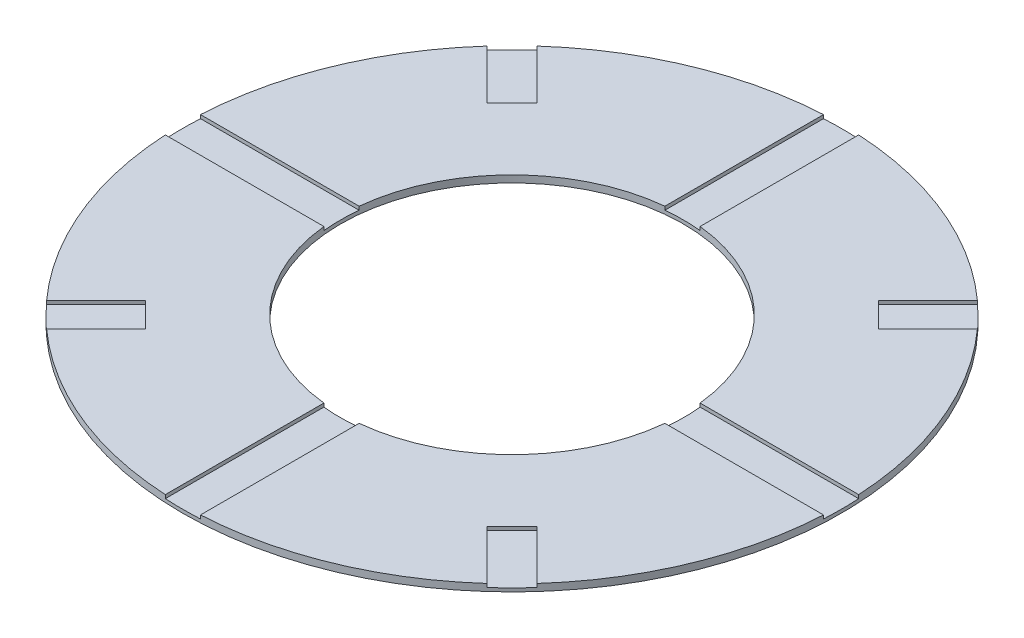
ISO-10303-21;
HEADER;
FILE_DESCRIPTION(('STEP AP214'),'2;1');
FILE_NAME('part.step','',(''),(''),'','','');
FILE_SCHEMA(('AUTOMOTIVE_DESIGN { 1 0 10303 214 1 1 1 1 }'));
ENDSEC;
DATA;
#1=APPLICATION_CONTEXT('core data for automotive mechanical design processes');
#2=APPLICATION_PROTOCOL_DEFINITION('international standard','automotive_design',2000,#1);
#3=PRODUCT_CONTEXT('',#1,'mechanical');
#4=PRODUCT('Part','Part','',(#3));
#5=PRODUCT_RELATED_PRODUCT_CATEGORY('part','',(#4));
#6=PRODUCT_DEFINITION_FORMATION('','',#4);
#7=PRODUCT_DEFINITION_CONTEXT('part definition',#1,'design');
#8=PRODUCT_DEFINITION('design','',#6,#7);
#9=PRODUCT_DEFINITION_SHAPE('','',#8);
#10=(LENGTH_UNIT() NAMED_UNIT(*) SI_UNIT(.MILLI.,.METRE.));
#11=(NAMED_UNIT(*) PLANE_ANGLE_UNIT() SI_UNIT($,.RADIAN.));
#12=(NAMED_UNIT(*) SI_UNIT($,.STERADIAN.) SOLID_ANGLE_UNIT());
#13=UNCERTAINTY_MEASURE_WITH_UNIT(LENGTH_MEASURE(1.E-05),#10,'distance_accuracy_value','');
#14=(GEOMETRIC_REPRESENTATION_CONTEXT(3) GLOBAL_UNCERTAINTY_ASSIGNED_CONTEXT((#13)) GLOBAL_UNIT_ASSIGNED_CONTEXT((#10,
#11,#12)) REPRESENTATION_CONTEXT('',''));
#15=CARTESIAN_POINT('',(0.,0.,0.));
#16=DIRECTION('',(0.,0.,1.));
#17=DIRECTION('',(1.,0.,0.));
#18=AXIS2_PLACEMENT_3D('',#15,#16,#17);
#19=CARTESIAN_POINT('',(0.,0.2,0.));
#20=DIRECTION('',(0.,-1.,0.));
#21=DIRECTION('',(0.,0.,-1.));
#22=AXIS2_PLACEMENT_3D('',#19,#20,#21);
#23=CYLINDRICAL_SURFACE('',#22,9.365);
#24=CARTESIAN_POINT('',(0.,0.,0.));
#25=DIRECTION('',(0.,1.,0.));
#26=DIRECTION('',(0.,0.,1.));
#27=AXIS2_PLACEMENT_3D('',#24,#25,#26);
#28=CIRCLE('',#27,9.365);
#29=CARTESIAN_POINT('',(0.,0.,9.365));
#30=VERTEX_POINT('',#29);
#31=EDGE_CURVE('E37',#30,#30,#28,.T.);
#32=ORIENTED_EDGE('',*,*,#31,.T.);
#33=EDGE_LOOP('',(#32));
#34=FACE_BOUND('',#33,.T.);
#35=DIRECTION('',(0.,1.,0.));
#36=VECTOR('',#35,1.);
#37=CARTESIAN_POINT('',(-6.96616350309803,0.1,-6.25905672191146));
#38=LINE('',#37,#36);
#39=CARTESIAN_POINT('',(-6.96616350309803,0.1,-6.25905672191146));
#40=VERTEX_POINT('',#39);
#41=CARTESIAN_POINT('',(-6.96616350309803,0.2,-6.25905672191146));
#42=VERTEX_POINT('',#41);
#43=EDGE_CURVE('E278',#40,#42,#38,.T.);
#44=ORIENTED_EDGE('',*,*,#43,.F.);
#45=CARTESIAN_POINT('',(0.,0.1,0.));
#46=DIRECTION('',(0.,1.,0.));
#47=DIRECTION('',(0.,0.,1.));
#48=AXIS2_PLACEMENT_3D('',#45,#46,#47);
#49=CIRCLE('',#48,9.365);
#50=CARTESIAN_POINT('',(-6.25905672191148,0.1,-6.966163503098));
#51=VERTEX_POINT('',#50);
#52=EDGE_CURVE('E257',#51,#40,#49,.T.);
#53=ORIENTED_EDGE('',*,*,#52,.F.);
#54=DIRECTION('',(0.,1.,0.));
#55=VECTOR('',#54,1.);
#56=CARTESIAN_POINT('',(-6.25905672191148,0.1,-6.966163503098));
#57=LINE('',#56,#55);
#58=CARTESIAN_POINT('',(-6.25905672191148,0.2,-6.966163503098));
#59=VERTEX_POINT('',#58);
#60=EDGE_CURVE('E252',#51,#59,#57,.T.);
#61=ORIENTED_EDGE('',*,*,#60,.T.);
#62=CARTESIAN_POINT('',(0.,0.2,0.));
#63=DIRECTION('',(0.,1.,0.));
#64=DIRECTION('',(0.,0.,1.));
#65=AXIS2_PLACEMENT_3D('',#62,#63,#64);
#66=CIRCLE('',#65,9.365);
#67=CARTESIAN_POINT('',(-0.5,0.2,-9.35164290378968));
#68=VERTEX_POINT('',#67);
#69=EDGE_CURVE('E11',#68,#59,#66,.T.);
#70=ORIENTED_EDGE('',*,*,#69,.F.);
#71=DIRECTION('',(0.,1.,0.));
#72=VECTOR('',#71,1.);
#73=CARTESIAN_POINT('',(-0.5,0.1,-9.35164290378968));
#74=LINE('',#73,#72);
#75=CARTESIAN_POINT('',(-0.5,0.1,-9.35164290378968));
#76=VERTEX_POINT('',#75);
#77=EDGE_CURVE('E467',#76,#68,#74,.T.);
#78=ORIENTED_EDGE('',*,*,#77,.F.);
#79=CARTESIAN_POINT('',(0.,0.1,0.));
#80=DIRECTION('',(0.,1.,0.));
#81=DIRECTION('',(0.,0.,1.));
#82=AXIS2_PLACEMENT_3D('',#79,#80,#81);
#83=CIRCLE('',#82,9.365);
#84=CARTESIAN_POINT('',(0.5,0.1,-9.35164290378968));
#85=VERTEX_POINT('',#84);
#86=EDGE_CURVE('E447',#85,#76,#83,.T.);
#87=ORIENTED_EDGE('',*,*,#86,.F.);
#88=DIRECTION('',(0.,1.,0.));
#89=VECTOR('',#88,1.);
#90=CARTESIAN_POINT('',(0.5,0.1,-9.35164290378968));
#91=LINE('',#90,#89);
#92=CARTESIAN_POINT('',(0.5,0.2,-9.35164290378968));
#93=VERTEX_POINT('',#92);
#94=EDGE_CURVE('E456',#85,#93,#91,.T.);
#95=ORIENTED_EDGE('',*,*,#94,.T.);
#96=CARTESIAN_POINT('',(6.25905672191146,0.2,-6.96616350309803));
#97=VERTEX_POINT('',#96);
#98=EDGE_CURVE('E535',#97,#93,#66,.T.);
#99=ORIENTED_EDGE('',*,*,#98,.F.);
#100=DIRECTION('',(0.,1.,0.));
#101=VECTOR('',#100,1.);
#102=CARTESIAN_POINT('',(6.25905672191146,0.1,-6.96616350309803));
#103=LINE('',#102,#101);
#104=CARTESIAN_POINT('',(6.25905672191146,0.1,-6.96616350309803));
#105=VERTEX_POINT('',#104);
#106=EDGE_CURVE('E356',#105,#97,#103,.T.);
#107=ORIENTED_EDGE('',*,*,#106,.F.);
#108=CARTESIAN_POINT('',(0.,0.1,0.));
#109=DIRECTION('',(0.,1.,0.));
#110=DIRECTION('',(0.,0.,1.));
#111=AXIS2_PLACEMENT_3D('',#108,#109,#110);
#112=CIRCLE('',#111,9.365);
#113=CARTESIAN_POINT('',(6.966163503098,0.1,-6.25905672191148));
#114=VERTEX_POINT('',#113);
#115=EDGE_CURVE('E345',#114,#105,#112,.T.);
#116=ORIENTED_EDGE('',*,*,#115,.F.);
#117=DIRECTION('',(0.,1.,0.));
#118=VECTOR('',#117,1.);
#119=CARTESIAN_POINT('',(6.966163503098,0.1,-6.25905672191148));
#120=LINE('',#119,#118);
#121=CARTESIAN_POINT('',(6.966163503098,0.2,-6.25905672191148));
#122=VERTEX_POINT('',#121);
#123=EDGE_CURVE('E359',#114,#122,#120,.T.);
#124=ORIENTED_EDGE('',*,*,#123,.T.);
#125=CARTESIAN_POINT('',(9.35164290378968,0.2,-0.5));
#126=VERTEX_POINT('',#125);
#127=EDGE_CURVE('E583',#126,#122,#66,.T.);
#128=ORIENTED_EDGE('',*,*,#127,.F.);
#129=DIRECTION('',(0.,1.,0.));
#130=VECTOR('',#129,1.);
#131=CARTESIAN_POINT('',(9.35164290378968,0.1,-0.5));
#132=LINE('',#131,#130);
#133=CARTESIAN_POINT('',(9.35164290378968,0.1,-0.5));
#134=VERTEX_POINT('',#133);
#135=EDGE_CURVE('E387',#134,#126,#132,.T.);
#136=ORIENTED_EDGE('',*,*,#135,.F.);
#137=CARTESIAN_POINT('',(0.,0.1,0.));
#138=DIRECTION('',(0.,1.,0.));
#139=DIRECTION('',(0.,0.,1.));
#140=AXIS2_PLACEMENT_3D('',#137,#138,#139);
#141=CIRCLE('',#140,9.365);
#142=CARTESIAN_POINT('',(9.35164290378968,0.1,0.5));
#143=VERTEX_POINT('',#142);
#144=EDGE_CURVE('E373',#143,#134,#141,.T.);
#145=ORIENTED_EDGE('',*,*,#144,.F.);
#146=DIRECTION('',(0.,1.,0.));
#147=VECTOR('',#146,1.);
#148=CARTESIAN_POINT('',(9.35164290378968,0.1,0.5));
#149=LINE('',#148,#147);
#150=CARTESIAN_POINT('',(9.35164290378968,0.2,0.5));
#151=VERTEX_POINT('',#150);
#152=EDGE_CURVE('E389',#143,#151,#149,.T.);
#153=ORIENTED_EDGE('',*,*,#152,.T.);
#154=CARTESIAN_POINT('',(6.96616350309803,0.2,6.25905672191145));
#155=VERTEX_POINT('',#154);
#156=EDGE_CURVE('E519',#155,#151,#66,.T.);
#157=ORIENTED_EDGE('',*,*,#156,.F.);
#158=DIRECTION('',(0.,1.,0.));
#159=VECTOR('',#158,1.);
#160=CARTESIAN_POINT('',(6.96616350309803,0.1,6.25905672191145));
#161=LINE('',#160,#159);
#162=CARTESIAN_POINT('',(6.96616350309803,0.1,6.25905672191145));
#163=VERTEX_POINT('',#162);
#164=EDGE_CURVE('E331',#163,#155,#161,.T.);
#165=ORIENTED_EDGE('',*,*,#164,.F.);
#166=CARTESIAN_POINT('',(0.,0.1,0.));
#167=DIRECTION('',(0.,1.,0.));
#168=DIRECTION('',(0.,0.,1.));
#169=AXIS2_PLACEMENT_3D('',#166,#167,#168);
#170=CIRCLE('',#169,9.365);
#171=CARTESIAN_POINT('',(6.25905672191149,0.1,6.966163503098));
#172=VERTEX_POINT('',#171);
#173=EDGE_CURVE('E314',#172,#163,#170,.T.);
#174=ORIENTED_EDGE('',*,*,#173,.F.);
#175=DIRECTION('',(0.,1.,0.));
#176=VECTOR('',#175,1.);
#177=CARTESIAN_POINT('',(6.25905672191149,0.1,6.966163503098));
#178=LINE('',#177,#176);
#179=CARTESIAN_POINT('',(6.25905672191149,0.2,6.966163503098));
#180=VERTEX_POINT('',#179);
#181=EDGE_CURVE('E333',#172,#180,#178,.T.);
#182=ORIENTED_EDGE('',*,*,#181,.T.);
#183=CARTESIAN_POINT('',(0.500000000000005,0.2,9.35164290378968));
#184=VERTEX_POINT('',#183);
#185=EDGE_CURVE('E584',#184,#180,#66,.T.);
#186=ORIENTED_EDGE('',*,*,#185,.F.);
#187=DIRECTION('',(0.,1.,0.));
#188=VECTOR('',#187,1.);
#189=CARTESIAN_POINT('',(0.500000000000005,0.1,9.35164290378968));
#190=LINE('',#189,#188);
#191=CARTESIAN_POINT('',(0.500000000000005,0.1,9.35164290378968));
#192=VERTEX_POINT('',#191);
#193=EDGE_CURVE('E410',#192,#184,#190,.T.);
#194=ORIENTED_EDGE('',*,*,#193,.F.);
#195=CARTESIAN_POINT('',(0.,0.1,0.));
#196=DIRECTION('',(0.,1.,0.));
#197=DIRECTION('',(0.,0.,1.));
#198=AXIS2_PLACEMENT_3D('',#195,#196,#197);
#199=CIRCLE('',#198,9.365);
#200=CARTESIAN_POINT('',(-0.5,0.1,9.35164290378968));
#201=VERTEX_POINT('',#200);
#202=EDGE_CURVE('E402',#201,#192,#199,.T.);
#203=ORIENTED_EDGE('',*,*,#202,.F.);
#204=DIRECTION('',(0.,1.,0.));
#205=VECTOR('',#204,1.);
#206=CARTESIAN_POINT('',(-0.5,0.1,9.35164290378968));
#207=LINE('',#206,#205);
#208=CARTESIAN_POINT('',(-0.5,0.2,9.35164290378968));
#209=VERTEX_POINT('',#208);
#210=EDGE_CURVE('E413',#201,#209,#207,.T.);
#211=ORIENTED_EDGE('',*,*,#210,.T.);
#212=CARTESIAN_POINT('',(-6.25905672191145,0.2,6.96616350309803));
#213=VERTEX_POINT('',#212);
#214=EDGE_CURVE('E501',#213,#209,#66,.T.);
#215=ORIENTED_EDGE('',*,*,#214,.F.);
#216=DIRECTION('',(0.,1.,0.));
#217=VECTOR('',#216,1.);
#218=CARTESIAN_POINT('',(-6.25905672191145,0.1,6.96616350309803));
#219=LINE('',#218,#217);
#220=CARTESIAN_POINT('',(-6.25905672191145,0.1,6.96616350309803));
#221=VERTEX_POINT('',#220);
#222=EDGE_CURVE('E302',#221,#213,#219,.T.);
#223=ORIENTED_EDGE('',*,*,#222,.F.);
#224=CARTESIAN_POINT('',(0.,0.1,0.));
#225=DIRECTION('',(0.,1.,0.));
#226=DIRECTION('',(0.,0.,1.));
#227=AXIS2_PLACEMENT_3D('',#224,#225,#226);
#228=CIRCLE('',#227,9.365);
#229=CARTESIAN_POINT('',(-6.966163503098,0.1,6.25905672191149));
#230=VERTEX_POINT('',#229);
#231=EDGE_CURVE('E287',#230,#221,#228,.T.);
#232=ORIENTED_EDGE('',*,*,#231,.F.);
#233=DIRECTION('',(0.,1.,0.));
#234=VECTOR('',#233,1.);
#235=CARTESIAN_POINT('',(-6.966163503098,0.1,6.25905672191149));
#236=LINE('',#235,#234);
#237=CARTESIAN_POINT('',(-6.966163503098,0.2,6.25905672191149));
#238=VERTEX_POINT('',#237);
#239=EDGE_CURVE('E304',#230,#238,#236,.T.);
#240=ORIENTED_EDGE('',*,*,#239,.T.);
#241=CARTESIAN_POINT('',(-9.35164290378968,0.2,0.5));
#242=VERTEX_POINT('',#241);
#243=EDGE_CURVE('E43',#242,#238,#66,.T.);
#244=ORIENTED_EDGE('',*,*,#243,.F.);
#245=DIRECTION('',(0.,1.,0.));
#246=VECTOR('',#245,1.);
#247=CARTESIAN_POINT('',(-9.35164290378968,0.1,0.5));
#248=LINE('',#247,#246);
#249=CARTESIAN_POINT('',(-9.35164290378968,0.1,0.5));
#250=VERTEX_POINT('',#249);
#251=EDGE_CURVE('E431',#250,#242,#248,.T.);
#252=ORIENTED_EDGE('',*,*,#251,.F.);
#253=CARTESIAN_POINT('',(0.,0.1,0.));
#254=DIRECTION('',(0.,1.,0.));
#255=DIRECTION('',(0.,0.,1.));
#256=AXIS2_PLACEMENT_3D('',#253,#254,#255);
#257=CIRCLE('',#256,9.365);
#258=CARTESIAN_POINT('',(-9.35164290378968,0.1,-0.5));
#259=VERTEX_POINT('',#258);
#260=EDGE_CURVE('E420',#259,#250,#257,.T.);
#261=ORIENTED_EDGE('',*,*,#260,.F.);
#262=DIRECTION('',(0.,1.,0.));
#263=VECTOR('',#262,1.);
#264=CARTESIAN_POINT('',(-9.35164290378968,0.1,-0.5));
#265=LINE('',#264,#263);
#266=CARTESIAN_POINT('',(-9.35164290378968,0.2,-0.5));
#267=VERTEX_POINT('',#266);
#268=EDGE_CURVE('E435',#259,#267,#265,.T.);
#269=ORIENTED_EDGE('',*,*,#268,.T.);
#270=EDGE_CURVE('E42',#42,#267,#66,.T.);
#271=ORIENTED_EDGE('',*,*,#270,.F.);
#272=EDGE_LOOP('',(#44,#53,#61,#70,#78,#87,#95,#99,#107,#116,#124,#128,#136,#145,#153,#157,#165,
#174,#182,#186,#194,#203,#211,#215,#223,#232,#240,#244,#252,#261,#269,#271));
#273=FACE_BOUND('',#272,.T.);
#274=ADVANCED_FACE('F34',(#34,#273),#23,.T.);
#275=CARTESIAN_POINT('',(0.,0.2,0.));
#276=DIRECTION('',(0.,1.,0.));
#277=DIRECTION('',(0.,0.,1.));
#278=AXIS2_PLACEMENT_3D('',#275,#276,#277);
#279=PLANE('',#278);
#280=DIRECTION('',(-0.707106781186546,0.,0.707106781186549));
#281=VECTOR('',#280,1.);
#282=CARTESIAN_POINT('',(-5.20784144343893,0.2,-5.20784144343891));
#283=LINE('',#282,#281);
#284=CARTESIAN_POINT('',(-4.85428805284566,0.2,-5.56139483403218));
#285=VERTEX_POINT('',#284);
#286=CARTESIAN_POINT('',(-5.5613948340322,0.2,-4.85428805284564));
#287=VERTEX_POINT('',#286);
#288=EDGE_CURVE('E50',#285,#287,#283,.T.);
#289=ORIENTED_EDGE('',*,*,#288,.T.);
#290=DIRECTION('',(-0.707106781186549,0.,-0.707106781186546));
#291=VECTOR('',#290,1.);
#292=CARTESIAN_POINT('',(-0.353553390593273,0.2,0.353553390593275));
#293=LINE('',#292,#291);
#294=EDGE_CURVE('E266',#287,#42,#293,.T.);
#295=ORIENTED_EDGE('',*,*,#294,.T.);
#296=ORIENTED_EDGE('',*,*,#270,.T.);
#297=DIRECTION('',(1.,0.,0.));
#298=VECTOR('',#297,1.);
#299=CARTESIAN_POINT('',(0.,0.2,-0.5));
#300=LINE('',#299,#298);
#301=CARTESIAN_POINT('',(-4.84426465007848,0.2,-0.5));
#302=VERTEX_POINT('',#301);
#303=EDGE_CURVE('E424',#267,#302,#300,.T.);
#304=ORIENTED_EDGE('',*,*,#303,.T.);
#305=CARTESIAN_POINT('',(0.,0.2,0.));
#306=DIRECTION('',(0.,1.,0.));
#307=DIRECTION('',(0.,0.,1.));
#308=AXIS2_PLACEMENT_3D('',#305,#306,#307);
#309=CIRCLE('',#308,4.87);
#310=CARTESIAN_POINT('',(-0.5,0.2,-4.84426465007848));
#311=VERTEX_POINT('',#310);
#312=EDGE_CURVE('E471',#311,#302,#309,.T.);
#313=ORIENTED_EDGE('',*,*,#312,.F.);
#314=DIRECTION('',(0.,0.,1.));
#315=VECTOR('',#314,1.);
#316=CARTESIAN_POINT('',(-0.5,0.2,0.));
#317=LINE('',#316,#315);
#318=EDGE_CURVE('E448',#68,#311,#317,.T.);
#319=ORIENTED_EDGE('',*,*,#318,.F.);
#320=ORIENTED_EDGE('',*,*,#69,.T.);
#321=DIRECTION('',(0.707106781186549,0.,0.707106781186546));
#322=VECTOR('',#321,1.);
#323=CARTESIAN_POINT('',(0.353553390593271,0.2,-0.353553390593272));
#324=LINE('',#323,#322);
#325=EDGE_CURVE('E269',#59,#285,#324,.T.);
#326=ORIENTED_EDGE('',*,*,#325,.T.);
#327=EDGE_LOOP('',(#289,#295,#296,#304,#313,#319,#320,#326));
#328=FACE_BOUND('',#327,.T.);
#329=ADVANCED_FACE('F552',(#328),#279,.T.);
#330=DIRECTION('',(0.707106781186549,0.,0.707106781186546));
#331=VECTOR('',#330,1.);
#332=CARTESIAN_POINT('',(-5.2078414434389,0.2,5.20784144343893));
#333=LINE('',#332,#331);
#334=CARTESIAN_POINT('',(-5.56139483403218,0.2,4.85428805284566));
#335=VERTEX_POINT('',#334);
#336=CARTESIAN_POINT('',(-4.85428805284563,0.2,5.56139483403221));
#337=VERTEX_POINT('',#336);
#338=EDGE_CURVE('E58',#335,#337,#333,.T.);
#339=ORIENTED_EDGE('',*,*,#338,.T.);
#340=DIRECTION('',(-0.707106781186546,0.,0.707106781186549));
#341=VECTOR('',#340,1.);
#342=CARTESIAN_POINT('',(0.353553390593282,0.2,0.353553390593281));
#343=LINE('',#342,#341);
#344=EDGE_CURVE('E285',#337,#213,#343,.T.);
#345=ORIENTED_EDGE('',*,*,#344,.T.);
#346=ORIENTED_EDGE('',*,*,#214,.T.);
#347=DIRECTION('',(0.,0.,1.));
#348=VECTOR('',#347,1.);
#349=CARTESIAN_POINT('',(-0.5,0.2,0.));
#350=LINE('',#349,#348);
#351=CARTESIAN_POINT('',(-0.5,0.2,4.84426465007848));
#352=VERTEX_POINT('',#351);
#353=EDGE_CURVE('E396',#352,#209,#350,.T.);
#354=ORIENTED_EDGE('',*,*,#353,.F.);
#355=CARTESIAN_POINT('',(-4.84426465007848,0.2,0.5));
#356=VERTEX_POINT('',#355);
#357=EDGE_CURVE('E474',#356,#352,#309,.T.);
#358=ORIENTED_EDGE('',*,*,#357,.F.);
#359=DIRECTION('',(1.,0.,0.));
#360=VECTOR('',#359,1.);
#361=CARTESIAN_POINT('',(0.,0.2,0.5));
#362=LINE('',#361,#360);
#363=EDGE_CURVE('E412',#242,#356,#362,.T.);
#364=ORIENTED_EDGE('',*,*,#363,.F.);
#365=ORIENTED_EDGE('',*,*,#243,.T.);
#366=DIRECTION('',(0.707106781186546,0.,-0.70710678118655));
#367=VECTOR('',#366,1.);
#368=CARTESIAN_POINT('',(-0.353553390593275,0.2,-0.353553390593273));
#369=LINE('',#368,#367);
#370=EDGE_CURVE('E294',#238,#335,#369,.T.);
#371=ORIENTED_EDGE('',*,*,#370,.T.);
#372=EDGE_LOOP('',(#339,#345,#346,#354,#358,#364,#365,#371));
#373=FACE_BOUND('',#372,.T.);
#374=ADVANCED_FACE('F497',(#373),#279,.T.);
#375=DIRECTION('',(0.707106781186546,0.,-0.707106781186549));
#376=VECTOR('',#375,1.);
#377=CARTESIAN_POINT('',(5.20784144343893,0.2,5.20784144343891));
#378=LINE('',#377,#376);
#379=CARTESIAN_POINT('',(4.85428805284566,0.2,5.56139483403218));
#380=VERTEX_POINT('',#379);
#381=CARTESIAN_POINT('',(5.56139483403221,0.2,4.85428805284563));
#382=VERTEX_POINT('',#381);
#383=EDGE_CURVE('E301',#380,#382,#378,.T.);
#384=ORIENTED_EDGE('',*,*,#383,.T.);
#385=DIRECTION('',(0.707106781186548,0.,0.707106781186547));
#386=VECTOR('',#385,1.);
#387=CARTESIAN_POINT('',(0.353553390593284,0.2,-0.353553390593285));
#388=LINE('',#387,#386);
#389=EDGE_CURVE('E312',#382,#155,#388,.T.);
#390=ORIENTED_EDGE('',*,*,#389,.T.);
#391=ORIENTED_EDGE('',*,*,#156,.T.);
#392=DIRECTION('',(1.,0.,0.));
#393=VECTOR('',#392,1.);
#394=CARTESIAN_POINT('',(0.,0.2,0.5));
#395=LINE('',#394,#393);
#396=CARTESIAN_POINT('',(4.84426465007848,0.2,0.5));
#397=VERTEX_POINT('',#396);
#398=EDGE_CURVE('E358',#397,#151,#395,.T.);
#399=ORIENTED_EDGE('',*,*,#398,.F.);
#400=CARTESIAN_POINT('',(0.500000000000003,0.2,4.84426465007848));
#401=VERTEX_POINT('',#400);
#402=EDGE_CURVE('E479',#401,#397,#309,.T.);
#403=ORIENTED_EDGE('',*,*,#402,.F.);
#404=DIRECTION('',(0.,0.,1.));
#405=VECTOR('',#404,1.);
#406=CARTESIAN_POINT('',(0.500000000000002,0.2,0.));
#407=LINE('',#406,#405);
#408=EDGE_CURVE('E386',#401,#184,#407,.T.);
#409=ORIENTED_EDGE('',*,*,#408,.T.);
#410=ORIENTED_EDGE('',*,*,#185,.T.);
#411=DIRECTION('',(-0.707106781186549,0.,-0.707106781186546));
#412=VECTOR('',#411,1.);
#413=CARTESIAN_POINT('',(-0.353553390593271,0.2,0.353553390593273));
#414=LINE('',#413,#412);
#415=EDGE_CURVE('E322',#180,#380,#414,.T.);
#416=ORIENTED_EDGE('',*,*,#415,.T.);
#417=EDGE_LOOP('',(#384,#390,#391,#399,#403,#409,#410,#416));
#418=FACE_BOUND('',#417,.T.);
#419=ADVANCED_FACE('F516',(#418),#279,.T.);
#420=DIRECTION('',(-0.707106781186549,0.,-0.707106781186546));
#421=VECTOR('',#420,1.);
#422=CARTESIAN_POINT('',(5.20784144343891,0.2,-5.20784144343894));
#423=LINE('',#422,#421);
#424=CARTESIAN_POINT('',(5.56139483403219,0.2,-4.85428805284566));
#425=VERTEX_POINT('',#424);
#426=CARTESIAN_POINT('',(4.85428805284564,0.2,-5.56139483403221));
#427=VERTEX_POINT('',#426);
#428=EDGE_CURVE('E351',#425,#427,#423,.T.);
#429=ORIENTED_EDGE('',*,*,#428,.T.);
#430=DIRECTION('',(0.707106781186546,0.,-0.70710678118655));
#431=VECTOR('',#430,1.);
#432=CARTESIAN_POINT('',(-0.353553390593269,0.2,-0.353553390593267));
#433=LINE('',#432,#431);
#434=EDGE_CURVE('E330',#427,#97,#433,.T.);
#435=ORIENTED_EDGE('',*,*,#434,.T.);
#436=ORIENTED_EDGE('',*,*,#98,.T.);
#437=DIRECTION('',(0.,0.,1.));
#438=VECTOR('',#437,1.);
#439=CARTESIAN_POINT('',(0.500000000000002,0.2,0.));
#440=LINE('',#439,#438);
#441=CARTESIAN_POINT('',(0.500000000000001,0.2,-4.84426465007848));
#442=VERTEX_POINT('',#441);
#443=EDGE_CURVE('E438',#93,#442,#440,.T.);
#444=ORIENTED_EDGE('',*,*,#443,.T.);
#445=CARTESIAN_POINT('',(4.84426465007848,0.2,-0.5));
#446=VERTEX_POINT('',#445);
#447=EDGE_CURVE('E475',#446,#442,#309,.T.);
#448=ORIENTED_EDGE('',*,*,#447,.F.);
#449=DIRECTION('',(1.,0.,0.));
#450=VECTOR('',#449,1.);
#451=CARTESIAN_POINT('',(0.,0.2,-0.5));
#452=LINE('',#451,#450);
#453=EDGE_CURVE('E370',#446,#126,#452,.T.);
#454=ORIENTED_EDGE('',*,*,#453,.T.);
#455=ORIENTED_EDGE('',*,*,#127,.T.);
#456=DIRECTION('',(-0.707106781186546,0.,0.70710678118655));
#457=VECTOR('',#456,1.);
#458=CARTESIAN_POINT('',(0.353553390593279,0.2,0.353553390593277));
#459=LINE('',#458,#457);
#460=EDGE_CURVE('E341',#122,#425,#459,.T.);
#461=ORIENTED_EDGE('',*,*,#460,.T.);
#462=EDGE_LOOP('',(#429,#435,#436,#444,#448,#454,#455,#461));
#463=FACE_BOUND('',#462,.T.);
#464=ADVANCED_FACE('F531',(#463),#279,.T.);
#465=CARTESIAN_POINT('',(0.,0.2,0.));
#466=DIRECTION('',(0.,-1.,0.));
#467=DIRECTION('',(0.,0.,-1.));
#468=AXIS2_PLACEMENT_3D('',#465,#466,#467);
#469=CYLINDRICAL_SURFACE('',#468,4.87);
#470=CARTESIAN_POINT('',(0.,0.,0.));
#471=DIRECTION('',(0.,1.,0.));
#472=DIRECTION('',(0.,0.,1.));
#473=AXIS2_PLACEMENT_3D('',#470,#471,#472);
#474=CIRCLE('',#473,4.87);
#475=CARTESIAN_POINT('',(0.,0.,4.87));
#476=VERTEX_POINT('',#475);
#477=EDGE_CURVE('E463',#476,#476,#474,.T.);
#478=ORIENTED_EDGE('',*,*,#477,.F.);
#479=EDGE_LOOP('',(#478));
#480=FACE_BOUND('',#479,.T.);
#481=CARTESIAN_POINT('',(0.,0.1,0.));
#482=DIRECTION('',(0.,1.,0.));
#483=DIRECTION('',(0.,0.,1.));
#484=AXIS2_PLACEMENT_3D('',#481,#482,#483);
#485=CIRCLE('',#484,4.87);
#486=CARTESIAN_POINT('',(4.84426465007848,0.1,-0.5));
#487=VERTEX_POINT('',#486);
#488=CARTESIAN_POINT('',(4.84426465007848,0.1,0.5));
#489=VERTEX_POINT('',#488);
#490=EDGE_CURVE('E366',#487,#489,#485,.F.);
#491=ORIENTED_EDGE('',*,*,#490,.F.);
#492=DIRECTION('',(0.,1.,0.));
#493=VECTOR('',#492,1.);
#494=CARTESIAN_POINT('',(4.84426465007848,0.1,-0.5));
#495=LINE('',#494,#493);
#496=EDGE_CURVE('E383',#487,#446,#495,.T.);
#497=ORIENTED_EDGE('',*,*,#496,.T.);
#498=ORIENTED_EDGE('',*,*,#447,.T.);
#499=DIRECTION('',(0.,1.,0.));
#500=VECTOR('',#499,1.);
#501=CARTESIAN_POINT('',(0.500000000000001,0.1,-4.84426465007848));
#502=LINE('',#501,#500);
#503=CARTESIAN_POINT('',(0.500000000000001,0.1,-4.84426465007848));
#504=VERTEX_POINT('',#503);
#505=EDGE_CURVE('E460',#504,#442,#502,.T.);
#506=ORIENTED_EDGE('',*,*,#505,.F.);
#507=CARTESIAN_POINT('',(0.,0.1,0.));
#508=DIRECTION('',(0.,1.,0.));
#509=DIRECTION('',(0.,0.,1.));
#510=AXIS2_PLACEMENT_3D('',#507,#508,#509);
#511=CIRCLE('',#510,4.87);
#512=CARTESIAN_POINT('',(-0.5,0.1,-4.84426465007848));
#513=VERTEX_POINT('',#512);
#514=EDGE_CURVE('E453',#513,#504,#511,.F.);
#515=ORIENTED_EDGE('',*,*,#514,.F.);
#516=DIRECTION('',(0.,1.,0.));
#517=VECTOR('',#516,1.);
#518=CARTESIAN_POINT('',(-0.5,0.1,-4.84426465007848));
#519=LINE('',#518,#517);
#520=EDGE_CURVE('E464',#513,#311,#519,.T.);
#521=ORIENTED_EDGE('',*,*,#520,.T.);
#522=ORIENTED_EDGE('',*,*,#312,.T.);
#523=DIRECTION('',(0.,1.,0.));
#524=VECTOR('',#523,1.);
#525=CARTESIAN_POINT('',(-4.84426465007848,0.1,-0.5));
#526=LINE('',#525,#524);
#527=CARTESIAN_POINT('',(-4.84426465007848,0.1,-0.5));
#528=VERTEX_POINT('',#527);
#529=EDGE_CURVE('E439',#528,#302,#526,.T.);
#530=ORIENTED_EDGE('',*,*,#529,.F.);
#531=CARTESIAN_POINT('',(0.,0.1,0.));
#532=DIRECTION('',(0.,1.,0.));
#533=DIRECTION('',(0.,0.,1.));
#534=AXIS2_PLACEMENT_3D('',#531,#532,#533);
#535=CIRCLE('',#534,4.87);
#536=CARTESIAN_POINT('',(-4.84426465007848,0.1,0.5));
#537=VERTEX_POINT('',#536);
#538=EDGE_CURVE('E426',#537,#528,#535,.F.);
#539=ORIENTED_EDGE('',*,*,#538,.F.);
#540=DIRECTION('',(0.,1.,0.));
#541=VECTOR('',#540,1.);
#542=CARTESIAN_POINT('',(-4.84426465007848,0.1,0.5));
#543=LINE('',#542,#541);
#544=EDGE_CURVE('E441',#537,#356,#543,.T.);
#545=ORIENTED_EDGE('',*,*,#544,.T.);
#546=ORIENTED_EDGE('',*,*,#357,.T.);
#547=DIRECTION('',(0.,1.,0.));
#548=VECTOR('',#547,1.);
#549=CARTESIAN_POINT('',(-0.5,0.1,4.84426465007848));
#550=LINE('',#549,#548);
#551=CARTESIAN_POINT('',(-0.5,0.1,4.84426465007848));
#552=VERTEX_POINT('',#551);
#553=EDGE_CURVE('E416',#552,#352,#550,.T.);
#554=ORIENTED_EDGE('',*,*,#553,.F.);
#555=CARTESIAN_POINT('',(0.,0.1,0.));
#556=DIRECTION('',(0.,1.,0.));
#557=DIRECTION('',(0.,0.,1.));
#558=AXIS2_PLACEMENT_3D('',#555,#556,#557);
#559=CIRCLE('',#558,4.87);
#560=CARTESIAN_POINT('',(0.500000000000003,0.1,4.84426465007848));
#561=VERTEX_POINT('',#560);
#562=EDGE_CURVE('E395',#561,#552,#559,.F.);
#563=ORIENTED_EDGE('',*,*,#562,.F.);
#564=DIRECTION('',(0.,1.,0.));
#565=VECTOR('',#564,1.);
#566=CARTESIAN_POINT('',(0.500000000000003,0.1,4.84426465007848));
#567=LINE('',#566,#565);
#568=EDGE_CURVE('E405',#561,#401,#567,.T.);
#569=ORIENTED_EDGE('',*,*,#568,.T.);
#570=ORIENTED_EDGE('',*,*,#402,.T.);
#571=DIRECTION('',(0.,1.,0.));
#572=VECTOR('',#571,1.);
#573=CARTESIAN_POINT('',(4.84426465007848,0.1,0.5));
#574=LINE('',#573,#572);
#575=EDGE_CURVE('E378',#489,#397,#574,.T.);
#576=ORIENTED_EDGE('',*,*,#575,.F.);
#577=EDGE_LOOP('',(#491,#497,#498,#506,#515,#521,#522,#530,#539,#545,#546,#554,#563,#569,#570,#576));
#578=FACE_BOUND('',#577,.T.);
#579=ADVANCED_FACE('F490',(#480,#578),#469,.F.);
#580=CARTESIAN_POINT('',(0.,0.,0.));
#581=DIRECTION('',(0.,1.,0.));
#582=DIRECTION('',(0.,0.,1.));
#583=AXIS2_PLACEMENT_3D('',#580,#581,#582);
#584=PLANE('',#583);
#585=ORIENTED_EDGE('',*,*,#31,.F.);
#586=EDGE_LOOP('',(#585));
#587=FACE_BOUND('',#586,.T.);
#588=ORIENTED_EDGE('',*,*,#477,.T.);
#589=EDGE_LOOP('',(#588));
#590=FACE_BOUND('',#589,.T.);
#591=ADVANCED_FACE('F809',(#587,#590),#584,.F.);
#592=CARTESIAN_POINT('',(0.500000000000002,0.1,0.));
#593=DIRECTION('',(-1.,0.,0.));
#594=DIRECTION('',(0.,0.,1.));
#595=AXIS2_PLACEMENT_3D('',#592,#593,#594);
#596=PLANE('',#595);
#597=ORIENTED_EDGE('',*,*,#443,.F.);
#598=ORIENTED_EDGE('',*,*,#94,.F.);
#599=DIRECTION('',(0.,0.,1.));
#600=VECTOR('',#599,1.);
#601=CARTESIAN_POINT('',(0.500000000000002,0.1,0.));
#602=LINE('',#601,#600);
#603=EDGE_CURVE('E445',#85,#504,#602,.T.);
#604=ORIENTED_EDGE('',*,*,#603,.T.);
#605=ORIENTED_EDGE('',*,*,#505,.T.);
#606=EDGE_LOOP('',(#597,#598,#604,#605));
#607=FACE_BOUND('',#606,.T.);
#608=ADVANCED_FACE('F537',(#607),#596,.T.);
#609=CARTESIAN_POINT('',(-0.5,0.1,0.));
#610=DIRECTION('',(-1.,0.,0.));
#611=DIRECTION('',(0.,0.,1.));
#612=AXIS2_PLACEMENT_3D('',#609,#610,#611);
#613=PLANE('',#612);
#614=ORIENTED_EDGE('',*,*,#318,.T.);
#615=ORIENTED_EDGE('',*,*,#520,.F.);
#616=DIRECTION('',(0.,0.,1.));
#617=VECTOR('',#616,1.);
#618=CARTESIAN_POINT('',(-0.5,0.1,0.));
#619=LINE('',#618,#617);
#620=EDGE_CURVE('E451',#76,#513,#619,.T.);
#621=ORIENTED_EDGE('',*,*,#620,.F.);
#622=ORIENTED_EDGE('',*,*,#77,.T.);
#623=EDGE_LOOP('',(#614,#615,#621,#622));
#624=FACE_BOUND('',#623,.T.);
#625=ADVANCED_FACE('F792',(#624),#613,.F.);
#626=CARTESIAN_POINT('',(0.,0.1,0.));
#627=DIRECTION('',(0.,1.,0.));
#628=DIRECTION('',(0.,0.,1.));
#629=AXIS2_PLACEMENT_3D('',#626,#627,#628);
#630=PLANE('',#629);
#631=ORIENTED_EDGE('',*,*,#603,.F.);
#632=ORIENTED_EDGE('',*,*,#86,.T.);
#633=ORIENTED_EDGE('',*,*,#620,.T.);
#634=ORIENTED_EDGE('',*,*,#514,.T.);
#635=EDGE_LOOP('',(#631,#632,#633,#634));
#636=FACE_BOUND('',#635,.T.);
#637=ADVANCED_FACE('F544',(#636),#630,.T.);
#638=CARTESIAN_POINT('',(0.,0.1,-0.5));
#639=DIRECTION('',(0.,0.,1.));
#640=DIRECTION('',(1.,0.,0.));
#641=AXIS2_PLACEMENT_3D('',#638,#639,#640);
#642=PLANE('',#641);
#643=ORIENTED_EDGE('',*,*,#303,.F.);
#644=ORIENTED_EDGE('',*,*,#268,.F.);
#645=DIRECTION('',(1.,0.,0.));
#646=VECTOR('',#645,1.);
#647=CARTESIAN_POINT('',(0.,0.1,-0.5));
#648=LINE('',#647,#646);
#649=EDGE_CURVE('E429',#259,#528,#648,.T.);
#650=ORIENTED_EDGE('',*,*,#649,.T.);
#651=ORIENTED_EDGE('',*,*,#529,.T.);
#652=EDGE_LOOP('',(#643,#644,#650,#651));
#653=FACE_BOUND('',#652,.T.);
#654=ADVANCED_FACE('F556',(#653),#642,.T.);
#655=CARTESIAN_POINT('',(0.,0.1,0.5));
#656=DIRECTION('',(0.,0.,1.));
#657=DIRECTION('',(1.,0.,0.));
#658=AXIS2_PLACEMENT_3D('',#655,#656,#657);
#659=PLANE('',#658);
#660=ORIENTED_EDGE('',*,*,#363,.T.);
#661=ORIENTED_EDGE('',*,*,#544,.F.);
#662=DIRECTION('',(1.,0.,0.));
#663=VECTOR('',#662,1.);
#664=CARTESIAN_POINT('',(0.,0.1,0.5));
#665=LINE('',#664,#663);
#666=EDGE_CURVE('E423',#250,#537,#665,.T.);
#667=ORIENTED_EDGE('',*,*,#666,.F.);
#668=ORIENTED_EDGE('',*,*,#251,.T.);
#669=EDGE_LOOP('',(#660,#661,#667,#668));
#670=FACE_BOUND('',#669,.T.);
#671=ADVANCED_FACE('F563',(#670),#659,.F.);
#672=CARTESIAN_POINT('',(0.,0.1,0.));
#673=DIRECTION('',(0.,1.,0.));
#674=DIRECTION('',(0.,0.,1.));
#675=AXIS2_PLACEMENT_3D('',#672,#673,#674);
#676=PLANE('',#675);
#677=ORIENTED_EDGE('',*,*,#260,.T.);
#678=ORIENTED_EDGE('',*,*,#666,.T.);
#679=ORIENTED_EDGE('',*,*,#538,.T.);
#680=ORIENTED_EDGE('',*,*,#649,.F.);
#681=EDGE_LOOP('',(#677,#678,#679,#680));
#682=FACE_BOUND('',#681,.T.);
#683=ADVANCED_FACE('F561',(#682),#676,.T.);
#684=CARTESIAN_POINT('',(0.500000000000002,0.1,0.));
#685=DIRECTION('',(-1.,0.,0.));
#686=DIRECTION('',(0.,0.,1.));
#687=AXIS2_PLACEMENT_3D('',#684,#685,#686);
#688=PLANE('',#687);
#689=ORIENTED_EDGE('',*,*,#408,.F.);
#690=ORIENTED_EDGE('',*,*,#568,.F.);
#691=DIRECTION('',(0.,0.,1.));
#692=VECTOR('',#691,1.);
#693=CARTESIAN_POINT('',(0.500000000000002,0.1,0.));
#694=LINE('',#693,#692);
#695=EDGE_CURVE('E393',#561,#192,#694,.T.);
#696=ORIENTED_EDGE('',*,*,#695,.T.);
#697=ORIENTED_EDGE('',*,*,#193,.T.);
#698=EDGE_LOOP('',(#689,#690,#696,#697));
#699=FACE_BOUND('',#698,.T.);
#700=ADVANCED_FACE('F570',(#699),#688,.T.);
#701=CARTESIAN_POINT('',(-0.5,0.1,0.));
#702=DIRECTION('',(-1.,0.,0.));
#703=DIRECTION('',(0.,0.,1.));
#704=AXIS2_PLACEMENT_3D('',#701,#702,#703);
#705=PLANE('',#704);
#706=ORIENTED_EDGE('',*,*,#353,.T.);
#707=ORIENTED_EDGE('',*,*,#210,.F.);
#708=DIRECTION('',(0.,0.,1.));
#709=VECTOR('',#708,1.);
#710=CARTESIAN_POINT('',(-0.5,0.1,0.));
#711=LINE('',#710,#709);
#712=EDGE_CURVE('E399',#552,#201,#711,.T.);
#713=ORIENTED_EDGE('',*,*,#712,.F.);
#714=ORIENTED_EDGE('',*,*,#553,.T.);
#715=EDGE_LOOP('',(#706,#707,#713,#714));
#716=FACE_BOUND('',#715,.T.);
#717=ADVANCED_FACE('F503',(#716),#705,.F.);
#718=CARTESIAN_POINT('',(0.,0.1,0.));
#719=DIRECTION('',(0.,1.,0.));
#720=DIRECTION('',(0.,0.,1.));
#721=AXIS2_PLACEMENT_3D('',#718,#719,#720);
#722=PLANE('',#721);
#723=ORIENTED_EDGE('',*,*,#695,.F.);
#724=ORIENTED_EDGE('',*,*,#562,.T.);
#725=ORIENTED_EDGE('',*,*,#712,.T.);
#726=ORIENTED_EDGE('',*,*,#202,.T.);
#727=EDGE_LOOP('',(#723,#724,#725,#726));
#728=FACE_BOUND('',#727,.T.);
#729=ADVANCED_FACE('F512',(#728),#722,.T.);
#730=CARTESIAN_POINT('',(0.,0.1,-0.5));
#731=DIRECTION('',(0.,0.,1.));
#732=DIRECTION('',(1.,0.,0.));
#733=AXIS2_PLACEMENT_3D('',#730,#731,#732);
#734=PLANE('',#733);
#735=ORIENTED_EDGE('',*,*,#453,.F.);
#736=ORIENTED_EDGE('',*,*,#496,.F.);
#737=DIRECTION('',(1.,0.,0.));
#738=VECTOR('',#737,1.);
#739=CARTESIAN_POINT('',(0.,0.1,-0.5));
#740=LINE('',#739,#738);
#741=EDGE_CURVE('E376',#487,#134,#740,.T.);
#742=ORIENTED_EDGE('',*,*,#741,.T.);
#743=ORIENTED_EDGE('',*,*,#135,.T.);
#744=EDGE_LOOP('',(#735,#736,#742,#743));
#745=FACE_BOUND('',#744,.T.);
#746=ADVANCED_FACE('F641',(#745),#734,.T.);
#747=CARTESIAN_POINT('',(0.,0.1,0.5));
#748=DIRECTION('',(0.,0.,1.));
#749=DIRECTION('',(1.,0.,0.));
#750=AXIS2_PLACEMENT_3D('',#747,#748,#749);
#751=PLANE('',#750);
#752=ORIENTED_EDGE('',*,*,#398,.T.);
#753=ORIENTED_EDGE('',*,*,#152,.F.);
#754=DIRECTION('',(1.,0.,0.));
#755=VECTOR('',#754,1.);
#756=CARTESIAN_POINT('',(0.,0.1,0.5));
#757=LINE('',#756,#755);
#758=EDGE_CURVE('E369',#489,#143,#757,.T.);
#759=ORIENTED_EDGE('',*,*,#758,.F.);
#760=ORIENTED_EDGE('',*,*,#575,.T.);
#761=EDGE_LOOP('',(#752,#753,#759,#760));
#762=FACE_BOUND('',#761,.T.);
#763=ADVANCED_FACE('F521',(#762),#751,.F.);
#764=CARTESIAN_POINT('',(0.,0.1,0.));
#765=DIRECTION('',(0.,1.,0.));
#766=DIRECTION('',(0.,0.,1.));
#767=AXIS2_PLACEMENT_3D('',#764,#765,#766);
#768=PLANE('',#767);
#769=ORIENTED_EDGE('',*,*,#490,.T.);
#770=ORIENTED_EDGE('',*,*,#758,.T.);
#771=ORIENTED_EDGE('',*,*,#144,.T.);
#772=ORIENTED_EDGE('',*,*,#741,.F.);
#773=EDGE_LOOP('',(#769,#770,#771,#772));
#774=FACE_BOUND('',#773,.T.);
#775=ADVANCED_FACE('F528',(#774),#768,.T.);
#776=CARTESIAN_POINT('',(-0.353553390593269,0.1,-0.353553390593267));
#777=DIRECTION('',(0.707106781186549,0.,0.707106781186545));
#778=DIRECTION('',(0.707106781186546,0.,-0.70710678118655));
#779=AXIS2_PLACEMENT_3D('',#776,#777,#778);
#780=PLANE('',#779);
#781=ORIENTED_EDGE('',*,*,#434,.F.);
#782=DIRECTION('',(0.,1.,0.));
#783=VECTOR('',#782,1.);
#784=CARTESIAN_POINT('',(4.85428805284564,0.1,-5.56139483403221));
#785=LINE('',#784,#783);
#786=CARTESIAN_POINT('',(4.85428805284564,0.1,-5.56139483403221));
#787=VERTEX_POINT('',#786);
#788=EDGE_CURVE('E348',#787,#427,#785,.T.);
#789=ORIENTED_EDGE('',*,*,#788,.F.);
#790=DIRECTION('',(0.707106781186546,0.,-0.70710678118655));
#791=VECTOR('',#790,1.);
#792=CARTESIAN_POINT('',(-0.353553390593269,0.1,-0.353553390593267));
#793=LINE('',#792,#791);
#794=EDGE_CURVE('E338',#787,#105,#793,.T.);
#795=ORIENTED_EDGE('',*,*,#794,.T.);
#796=ORIENTED_EDGE('',*,*,#106,.T.);
#797=EDGE_LOOP('',(#781,#789,#795,#796));
#798=FACE_BOUND('',#797,.T.);
#799=ADVANCED_FACE('F631',(#798),#780,.T.);
#800=CARTESIAN_POINT('',(0.353553390593279,0.1,0.353553390593277));
#801=DIRECTION('',(-0.707106781186549,0.,-0.707106781186545));
#802=DIRECTION('',(-0.707106781186546,0.,0.70710678118655));
#803=AXIS2_PLACEMENT_3D('',#800,#801,#802);
#804=PLANE('',#803);
#805=ORIENTED_EDGE('',*,*,#460,.F.);
#806=ORIENTED_EDGE('',*,*,#123,.F.);
#807=DIRECTION('',(-0.707106781186546,0.,0.70710678118655));
#808=VECTOR('',#807,1.);
#809=CARTESIAN_POINT('',(0.353553390593279,0.1,0.353553390593277));
#810=LINE('',#809,#808);
#811=CARTESIAN_POINT('',(5.56139483403219,0.1,-4.85428805284566));
#812=VERTEX_POINT('',#811);
#813=EDGE_CURVE('E343',#114,#812,#810,.T.);
#814=ORIENTED_EDGE('',*,*,#813,.T.);
#815=DIRECTION('',(0.,1.,0.));
#816=VECTOR('',#815,1.);
#817=CARTESIAN_POINT('',(5.56139483403219,0.1,-4.85428805284566));
#818=LINE('',#817,#816);
#819=EDGE_CURVE('E362',#812,#425,#818,.T.);
#820=ORIENTED_EDGE('',*,*,#819,.T.);
#821=EDGE_LOOP('',(#805,#806,#814,#820));
#822=FACE_BOUND('',#821,.T.);
#823=ADVANCED_FACE('F628',(#822),#804,.T.);
#824=CARTESIAN_POINT('',(5.20784144343891,0.1,-5.20784144343894));
#825=DIRECTION('',(0.707106781186546,0.,-0.707106781186549));
#826=DIRECTION('',(-0.707106781186549,0.,-0.707106781186546));
#827=AXIS2_PLACEMENT_3D('',#824,#825,#826);
#828=PLANE('',#827);
#829=ORIENTED_EDGE('',*,*,#428,.F.);
#830=ORIENTED_EDGE('',*,*,#819,.F.);
#831=DIRECTION('',(-0.707106781186549,0.,-0.707106781186546));
#832=VECTOR('',#831,1.);
#833=CARTESIAN_POINT('',(5.20784144343891,0.1,-5.20784144343894));
#834=LINE('',#833,#832);
#835=EDGE_CURVE('E340',#812,#787,#834,.T.);
#836=ORIENTED_EDGE('',*,*,#835,.T.);
#837=ORIENTED_EDGE('',*,*,#788,.T.);
#838=EDGE_LOOP('',(#829,#830,#836,#837));
#839=FACE_BOUND('',#838,.T.);
#840=ADVANCED_FACE('F626',(#839),#828,.T.);
#841=CARTESIAN_POINT('',(0.,0.1,0.));
#842=DIRECTION('',(0.,1.,0.));
#843=DIRECTION('',(0.,0.,1.));
#844=AXIS2_PLACEMENT_3D('',#841,#842,#843);
#845=PLANE('',#844);
#846=ORIENTED_EDGE('',*,*,#794,.F.);
#847=ORIENTED_EDGE('',*,*,#835,.F.);
#848=ORIENTED_EDGE('',*,*,#813,.F.);
#849=ORIENTED_EDGE('',*,*,#115,.T.);
#850=EDGE_LOOP('',(#846,#847,#848,#849));
#851=FACE_BOUND('',#850,.T.);
#852=ADVANCED_FACE('F622',(#851),#845,.T.);
#853=CARTESIAN_POINT('',(5.20784144343893,0.1,5.20784144343891));
#854=DIRECTION('',(0.707106781186549,0.,0.707106781186546));
#855=DIRECTION('',(0.707106781186546,0.,-0.707106781186549));
#856=AXIS2_PLACEMENT_3D('',#853,#854,#855);
#857=PLANE('',#856);
#858=ORIENTED_EDGE('',*,*,#383,.F.);
#859=DIRECTION('',(0.,1.,0.));
#860=VECTOR('',#859,1.);
#861=CARTESIAN_POINT('',(4.85428805284566,0.1,5.56139483403218));
#862=LINE('',#861,#860);
#863=CARTESIAN_POINT('',(4.85428805284566,0.1,5.56139483403218));
#864=VERTEX_POINT('',#863);
#865=EDGE_CURVE('E319',#864,#380,#862,.T.);
#866=ORIENTED_EDGE('',*,*,#865,.F.);
#867=DIRECTION('',(0.707106781186546,0.,-0.707106781186549));
#868=VECTOR('',#867,1.);
#869=CARTESIAN_POINT('',(5.20784144343893,0.1,5.20784144343891));
#870=LINE('',#869,#868);
#871=CARTESIAN_POINT('',(5.56139483403221,0.1,4.85428805284563));
#872=VERTEX_POINT('',#871);
#873=EDGE_CURVE('E308',#864,#872,#870,.T.);
#874=ORIENTED_EDGE('',*,*,#873,.T.);
#875=DIRECTION('',(0.,1.,0.));
#876=VECTOR('',#875,1.);
#877=CARTESIAN_POINT('',(5.56139483403221,0.1,4.85428805284563));
#878=LINE('',#877,#876);
#879=EDGE_CURVE('E327',#872,#382,#878,.T.);
#880=ORIENTED_EDGE('',*,*,#879,.T.);
#881=EDGE_LOOP('',(#858,#866,#874,#880));
#882=FACE_BOUND('',#881,.T.);
#883=ADVANCED_FACE('F615',(#882),#857,.T.);
#884=CARTESIAN_POINT('',(0.353553390593284,0.1,-0.353553390593285));
#885=DIRECTION('',(-0.707106781186547,0.,0.707106781186548));
#886=DIRECTION('',(0.707106781186548,0.,0.707106781186547));
#887=AXIS2_PLACEMENT_3D('',#884,#885,#886);
#888=PLANE('',#887);
#889=ORIENTED_EDGE('',*,*,#389,.F.);
#890=ORIENTED_EDGE('',*,*,#879,.F.);
#891=DIRECTION('',(0.707106781186548,0.,0.707106781186547));
#892=VECTOR('',#891,1.);
#893=CARTESIAN_POINT('',(0.353553390593284,0.1,-0.353553390593285));
#894=LINE('',#893,#892);
#895=EDGE_CURVE('E317',#872,#163,#894,.T.);
#896=ORIENTED_EDGE('',*,*,#895,.T.);
#897=ORIENTED_EDGE('',*,*,#164,.T.);
#898=EDGE_LOOP('',(#889,#890,#896,#897));
#899=FACE_BOUND('',#898,.T.);
#900=ADVANCED_FACE('F612',(#899),#888,.T.);
#901=CARTESIAN_POINT('',(-0.353553390593271,0.1,0.353553390593273));
#902=DIRECTION('',(0.707106781186546,0.,-0.707106781186549));
#903=DIRECTION('',(-0.707106781186549,0.,-0.707106781186546));
#904=AXIS2_PLACEMENT_3D('',#901,#902,#903);
#905=PLANE('',#904);
#906=ORIENTED_EDGE('',*,*,#415,.F.);
#907=ORIENTED_EDGE('',*,*,#181,.F.);
#908=DIRECTION('',(-0.707106781186549,0.,-0.707106781186546));
#909=VECTOR('',#908,1.);
#910=CARTESIAN_POINT('',(-0.353553390593271,0.1,0.353553390593273));
#911=LINE('',#910,#909);
#912=EDGE_CURVE('E311',#172,#864,#911,.T.);
#913=ORIENTED_EDGE('',*,*,#912,.T.);
#914=ORIENTED_EDGE('',*,*,#865,.T.);
#915=EDGE_LOOP('',(#906,#907,#913,#914));
#916=FACE_BOUND('',#915,.T.);
#917=ADVANCED_FACE('F610',(#916),#905,.T.);
#918=CARTESIAN_POINT('',(0.,0.1,0.));
#919=DIRECTION('',(0.,1.,0.));
#920=DIRECTION('',(0.,0.,1.));
#921=AXIS2_PLACEMENT_3D('',#918,#919,#920);
#922=PLANE('',#921);
#923=ORIENTED_EDGE('',*,*,#873,.F.);
#924=ORIENTED_EDGE('',*,*,#912,.F.);
#925=ORIENTED_EDGE('',*,*,#173,.T.);
#926=ORIENTED_EDGE('',*,*,#895,.F.);
#927=EDGE_LOOP('',(#923,#924,#925,#926));
#928=FACE_BOUND('',#927,.T.);
#929=ADVANCED_FACE('F603',(#928),#922,.T.);
#930=CARTESIAN_POINT('',(-5.2078414434389,0.1,5.20784144343893));
#931=DIRECTION('',(-0.707106781186546,0.,0.707106781186549));
#932=DIRECTION('',(0.707106781186549,0.,0.707106781186546));
#933=AXIS2_PLACEMENT_3D('',#930,#931,#932);
#934=PLANE('',#933);
#935=ORIENTED_EDGE('',*,*,#338,.F.);
#936=DIRECTION('',(0.,1.,0.));
#937=VECTOR('',#936,1.);
#938=CARTESIAN_POINT('',(-5.56139483403218,0.1,4.85428805284566));
#939=LINE('',#938,#937);
#940=CARTESIAN_POINT('',(-5.56139483403218,0.1,4.85428805284566));
#941=VERTEX_POINT('',#940);
#942=EDGE_CURVE('E292',#941,#335,#939,.T.);
#943=ORIENTED_EDGE('',*,*,#942,.F.);
#944=DIRECTION('',(0.707106781186549,0.,0.707106781186546));
#945=VECTOR('',#944,1.);
#946=CARTESIAN_POINT('',(-5.2078414434389,0.1,5.20784144343893));
#947=LINE('',#946,#945);
#948=CARTESIAN_POINT('',(-4.85428805284563,0.1,5.56139483403221));
#949=VERTEX_POINT('',#948);
#950=EDGE_CURVE('E281',#941,#949,#947,.T.);
#951=ORIENTED_EDGE('',*,*,#950,.T.);
#952=DIRECTION('',(0.,1.,0.));
#953=VECTOR('',#952,1.);
#954=CARTESIAN_POINT('',(-4.85428805284563,0.1,5.56139483403221));
#955=LINE('',#954,#953);
#956=EDGE_CURVE('E299',#949,#337,#955,.T.);
#957=ORIENTED_EDGE('',*,*,#956,.T.);
#958=EDGE_LOOP('',(#935,#943,#951,#957));
#959=FACE_BOUND('',#958,.T.);
#960=ADVANCED_FACE('F593',(#959),#934,.T.);
#961=CARTESIAN_POINT('',(0.353553390593282,0.1,0.353553390593281));
#962=DIRECTION('',(-0.707106781186549,0.,-0.707106781186546));
#963=DIRECTION('',(-0.707106781186546,0.,0.707106781186549));
#964=AXIS2_PLACEMENT_3D('',#961,#962,#963);
#965=PLANE('',#964);
#966=ORIENTED_EDGE('',*,*,#344,.F.);
#967=ORIENTED_EDGE('',*,*,#956,.F.);
#968=DIRECTION('',(-0.707106781186546,0.,0.707106781186549));
#969=VECTOR('',#968,1.);
#970=CARTESIAN_POINT('',(0.353553390593282,0.1,0.353553390593281));
#971=LINE('',#970,#969);
#972=EDGE_CURVE('E290',#949,#221,#971,.T.);
#973=ORIENTED_EDGE('',*,*,#972,.T.);
#974=ORIENTED_EDGE('',*,*,#222,.T.);
#975=EDGE_LOOP('',(#966,#967,#973,#974));
#976=FACE_BOUND('',#975,.T.);
#977=ADVANCED_FACE('F595',(#976),#965,.T.);
#978=CARTESIAN_POINT('',(-0.353553390593275,0.1,-0.353553390593273));
#979=DIRECTION('',(0.707106781186549,0.,0.707106781186545));
#980=DIRECTION('',(0.707106781186546,0.,-0.70710678118655));
#981=AXIS2_PLACEMENT_3D('',#978,#979,#980);
#982=PLANE('',#981);
#983=ORIENTED_EDGE('',*,*,#370,.F.);
#984=ORIENTED_EDGE('',*,*,#239,.F.);
#985=DIRECTION('',(0.707106781186546,0.,-0.70710678118655));
#986=VECTOR('',#985,1.);
#987=CARTESIAN_POINT('',(-0.353553390593275,0.1,-0.353553390593273));
#988=LINE('',#987,#986);
#989=EDGE_CURVE('E284',#230,#941,#988,.T.);
#990=ORIENTED_EDGE('',*,*,#989,.T.);
#991=ORIENTED_EDGE('',*,*,#942,.T.);
#992=EDGE_LOOP('',(#983,#984,#990,#991));
#993=FACE_BOUND('',#992,.T.);
#994=ADVANCED_FACE('F588',(#993),#982,.T.);
#995=CARTESIAN_POINT('',(0.,0.1,0.));
#996=DIRECTION('',(0.,1.,0.));
#997=DIRECTION('',(0.,0.,1.));
#998=AXIS2_PLACEMENT_3D('',#995,#996,#997);
#999=PLANE('',#998);
#1000=ORIENTED_EDGE('',*,*,#950,.F.);
#1001=ORIENTED_EDGE('',*,*,#989,.F.);
#1002=ORIENTED_EDGE('',*,*,#231,.T.);
#1003=ORIENTED_EDGE('',*,*,#972,.F.);
#1004=EDGE_LOOP('',(#1000,#1001,#1002,#1003));
#1005=FACE_BOUND('',#1004,.T.);
#1006=ADVANCED_FACE('F591',(#1005),#999,.T.);
#1007=CARTESIAN_POINT('',(-5.20784144343893,0.1,-5.20784144343891));
#1008=DIRECTION('',(-0.707106781186549,0.,-0.707106781186546));
#1009=DIRECTION('',(-0.707106781186546,0.,0.707106781186549));
#1010=AXIS2_PLACEMENT_3D('',#1007,#1008,#1009);
#1011=PLANE('',#1010);
#1012=ORIENTED_EDGE('',*,*,#288,.F.);
#1013=DIRECTION('',(0.,1.,0.));
#1014=VECTOR('',#1013,1.);
#1015=CARTESIAN_POINT('',(-4.85428805284566,0.1,-5.56139483403218));
#1016=LINE('',#1015,#1014);
#1017=CARTESIAN_POINT('',(-4.85428805284566,0.1,-5.56139483403218));
#1018=VERTEX_POINT('',#1017);
#1019=EDGE_CURVE('E249',#1018,#285,#1016,.T.);
#1020=ORIENTED_EDGE('',*,*,#1019,.F.);
#1021=DIRECTION('',(-0.707106781186546,0.,0.707106781186549));
#1022=VECTOR('',#1021,1.);
#1023=CARTESIAN_POINT('',(-5.20784144343893,0.1,-5.20784144343891));
#1024=LINE('',#1023,#1022);
#1025=CARTESIAN_POINT('',(-5.5613948340322,0.1,-4.85428805284564));
#1026=VERTEX_POINT('',#1025);
#1027=EDGE_CURVE('E258',#1018,#1026,#1024,.T.);
#1028=ORIENTED_EDGE('',*,*,#1027,.T.);
#1029=DIRECTION('',(0.,1.,0.));
#1030=VECTOR('',#1029,1.);
#1031=CARTESIAN_POINT('',(-5.5613948340322,0.1,-4.85428805284564));
#1032=LINE('',#1031,#1030);
#1033=EDGE_CURVE('E276',#1026,#287,#1032,.T.);
#1034=ORIENTED_EDGE('',*,*,#1033,.T.);
#1035=EDGE_LOOP('',(#1012,#1020,#1028,#1034));
#1036=FACE_BOUND('',#1035,.T.);
#1037=ADVANCED_FACE('F261',(#1036),#1011,.T.);
#1038=CARTESIAN_POINT('',(-0.353553390593273,0.1,0.353553390593275));
#1039=DIRECTION('',(0.707106781186546,0.,-0.707106781186549));
#1040=DIRECTION('',(-0.707106781186549,0.,-0.707106781186546));
#1041=AXIS2_PLACEMENT_3D('',#1038,#1039,#1040);
#1042=PLANE('',#1041);
#1043=ORIENTED_EDGE('',*,*,#294,.F.);
#1044=ORIENTED_EDGE('',*,*,#1033,.F.);
#1045=DIRECTION('',(-0.707106781186549,0.,-0.707106781186546));
#1046=VECTOR('',#1045,1.);
#1047=CARTESIAN_POINT('',(-0.353553390593273,0.1,0.353553390593275));
#1048=LINE('',#1047,#1046);
#1049=EDGE_CURVE('E263',#1026,#40,#1048,.T.);
#1050=ORIENTED_EDGE('',*,*,#1049,.T.);
#1051=ORIENTED_EDGE('',*,*,#43,.T.);
#1052=EDGE_LOOP('',(#1043,#1044,#1050,#1051));
#1053=FACE_BOUND('',#1052,.T.);
#1054=ADVANCED_FACE('F742',(#1053),#1042,.T.);
#1055=CARTESIAN_POINT('',(0.353553390593271,0.1,-0.353553390593272));
#1056=DIRECTION('',(-0.707106781186546,0.,0.707106781186549));
#1057=DIRECTION('',(0.707106781186549,0.,0.707106781186546));
#1058=AXIS2_PLACEMENT_3D('',#1055,#1056,#1057);
#1059=PLANE('',#1058);
#1060=ORIENTED_EDGE('',*,*,#325,.F.);
#1061=ORIENTED_EDGE('',*,*,#60,.F.);
#1062=DIRECTION('',(0.707106781186549,0.,0.707106781186546));
#1063=VECTOR('',#1062,1.);
#1064=CARTESIAN_POINT('',(0.353553390593271,0.1,-0.353553390593272));
#1065=LINE('',#1064,#1063);
#1066=EDGE_CURVE('E247',#51,#1018,#1065,.T.);
#1067=ORIENTED_EDGE('',*,*,#1066,.T.);
#1068=ORIENTED_EDGE('',*,*,#1019,.T.);
#1069=EDGE_LOOP('',(#1060,#1061,#1067,#1068));
#1070=FACE_BOUND('',#1069,.T.);
#1071=ADVANCED_FACE('F248',(#1070),#1059,.T.);
#1072=CARTESIAN_POINT('',(0.,0.1,0.));
#1073=DIRECTION('',(0.,1.,0.));
#1074=DIRECTION('',(0.,0.,1.));
#1075=AXIS2_PLACEMENT_3D('',#1072,#1073,#1074);
#1076=PLANE('',#1075);
#1077=ORIENTED_EDGE('',*,*,#1027,.F.);
#1078=ORIENTED_EDGE('',*,*,#1066,.F.);
#1079=ORIENTED_EDGE('',*,*,#52,.T.);
#1080=ORIENTED_EDGE('',*,*,#1049,.F.);
#1081=EDGE_LOOP('',(#1077,#1078,#1079,#1080));
#1082=FACE_BOUND('',#1081,.T.);
#1083=ADVANCED_FACE('F265',(#1082),#1076,.T.);
#1084=CLOSED_SHELL('',(#274,#329,#374,#419,#464,#579,#591,#608,#625,#637,#654,#671,#683,#700,
#717,#729,#746,#763,#775,#799,#823,#840,#852,#883,#900,#917,#929,#960,#977,#994,#1006,#1037,
#1054,#1071,#1083));
#1085=MANIFOLD_SOLID_BREP('B2',#1084);
#1086=ADVANCED_BREP_SHAPE_REPRESENTATION('',(#18,#1085),#14);
#1087=SHAPE_DEFINITION_REPRESENTATION(#9,#1086);
ENDSEC;
END-ISO-10303-21;
